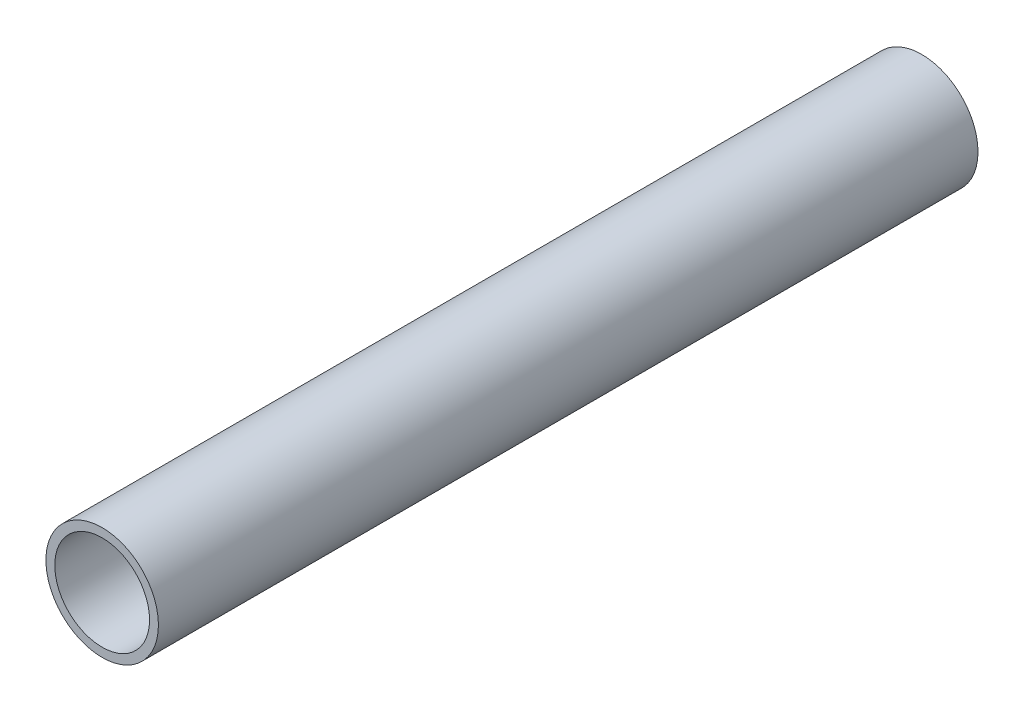
ISO-10303-21;
HEADER;
FILE_DESCRIPTION(('STEP AP214'),'2;1');
FILE_NAME('part.step','',(''),(''),'','','');
FILE_SCHEMA(('AUTOMOTIVE_DESIGN { 1 0 10303 214 1 1 1 1 }'));
ENDSEC;
DATA;
#1=APPLICATION_CONTEXT('core data for automotive mechanical design processes');
#2=APPLICATION_PROTOCOL_DEFINITION('international standard','automotive_design',2000,#1);
#3=PRODUCT_CONTEXT('',#1,'mechanical');
#4=PRODUCT('Part','Part','',(#3));
#5=PRODUCT_RELATED_PRODUCT_CATEGORY('part','',(#4));
#6=PRODUCT_DEFINITION_FORMATION('','',#4);
#7=PRODUCT_DEFINITION_CONTEXT('part definition',#1,'design');
#8=PRODUCT_DEFINITION('design','',#6,#7);
#9=PRODUCT_DEFINITION_SHAPE('','',#8);
#10=(LENGTH_UNIT() NAMED_UNIT(*) SI_UNIT(.MILLI.,.METRE.));
#11=(NAMED_UNIT(*) PLANE_ANGLE_UNIT() SI_UNIT($,.RADIAN.));
#12=(NAMED_UNIT(*) SI_UNIT($,.STERADIAN.) SOLID_ANGLE_UNIT());
#13=UNCERTAINTY_MEASURE_WITH_UNIT(LENGTH_MEASURE(1.E-05),#10,'distance_accuracy_value','');
#14=(GEOMETRIC_REPRESENTATION_CONTEXT(3) GLOBAL_UNCERTAINTY_ASSIGNED_CONTEXT((#13)) GLOBAL_UNIT_ASSIGNED_CONTEXT((#10,
#11,#12)) REPRESENTATION_CONTEXT('',''));
#15=CARTESIAN_POINT('',(0.,0.,0.));
#16=DIRECTION('',(0.,0.,1.));
#17=DIRECTION('',(1.,0.,0.));
#18=AXIS2_PLACEMENT_3D('',#15,#16,#17);
#19=CARTESIAN_POINT('',(0.,0.,185.));
#20=DIRECTION('',(0.,0.,1.));
#21=DIRECTION('',(1.,0.,0.));
#22=AXIS2_PLACEMENT_3D('',#19,#20,#21);
#23=PLANE('',#22);
#24=CARTESIAN_POINT('',(0.,0.,185.));
#25=DIRECTION('',(0.,0.,1.));
#26=DIRECTION('',(1.,0.,0.));
#27=AXIS2_PLACEMENT_3D('',#24,#25,#26);
#28=CIRCLE('',#27,12.7);
#29=CARTESIAN_POINT('',(12.7,0.,185.));
#30=VERTEX_POINT('',#29);
#31=EDGE_CURVE('E10',#30,#30,#28,.T.);
#32=ORIENTED_EDGE('',*,*,#31,.T.);
#33=EDGE_LOOP('',(#32));
#34=FACE_BOUND('',#33,.T.);
#35=CARTESIAN_POINT('',(0.,0.,185.));
#36=DIRECTION('',(0.,0.,1.));
#37=DIRECTION('',(1.,0.,0.));
#38=AXIS2_PLACEMENT_3D('',#35,#36,#37);
#39=CIRCLE('',#38,10.7);
#40=CARTESIAN_POINT('',(10.7,0.,185.));
#41=VERTEX_POINT('',#40);
#42=EDGE_CURVE('E43',#41,#41,#39,.T.);
#43=ORIENTED_EDGE('',*,*,#42,.F.);
#44=EDGE_LOOP('',(#43));
#45=FACE_BOUND('',#44,.T.);
#46=ADVANCED_FACE('F32',(#34,#45),#23,.T.);
#47=CARTESIAN_POINT('',(0.,0.,0.));
#48=DIRECTION('',(0.,0.,1.));
#49=DIRECTION('',(1.,0.,0.));
#50=AXIS2_PLACEMENT_3D('',#47,#48,#49);
#51=PLANE('',#50);
#52=CARTESIAN_POINT('',(0.,0.,0.));
#53=DIRECTION('',(0.,0.,1.));
#54=DIRECTION('',(1.,0.,0.));
#55=AXIS2_PLACEMENT_3D('',#52,#53,#54);
#56=CIRCLE('',#55,12.7);
#57=CARTESIAN_POINT('',(12.7,0.,0.));
#58=VERTEX_POINT('',#57);
#59=EDGE_CURVE('E36',#58,#58,#56,.T.);
#60=ORIENTED_EDGE('',*,*,#59,.F.);
#61=EDGE_LOOP('',(#60));
#62=FACE_BOUND('',#61,.T.);
#63=CARTESIAN_POINT('',(0.,0.,0.));
#64=DIRECTION('',(0.,0.,1.));
#65=DIRECTION('',(1.,0.,0.));
#66=AXIS2_PLACEMENT_3D('',#63,#64,#65);
#67=CIRCLE('',#66,10.7);
#68=CARTESIAN_POINT('',(10.7,0.,0.));
#69=VERTEX_POINT('',#68);
#70=EDGE_CURVE('E45',#69,#69,#67,.T.);
#71=ORIENTED_EDGE('',*,*,#70,.T.);
#72=EDGE_LOOP('',(#71));
#73=FACE_BOUND('',#72,.T.);
#74=ADVANCED_FACE('F55',(#62,#73),#51,.F.);
#75=CARTESIAN_POINT('',(0.,0.,185.));
#76=DIRECTION('',(0.,0.,-1.));
#77=DIRECTION('',(-1.,0.,0.));
#78=AXIS2_PLACEMENT_3D('',#75,#76,#77);
#79=CYLINDRICAL_SURFACE('',#78,12.7);
#80=ORIENTED_EDGE('',*,*,#31,.F.);
#81=EDGE_LOOP('',(#80));
#82=FACE_BOUND('',#81,.T.);
#83=ORIENTED_EDGE('',*,*,#59,.T.);
#84=EDGE_LOOP('',(#83));
#85=FACE_BOUND('',#84,.T.);
#86=ADVANCED_FACE('F34',(#82,#85),#79,.T.);
#87=CARTESIAN_POINT('',(0.,0.,185.));
#88=DIRECTION('',(0.,0.,-1.));
#89=DIRECTION('',(-1.,0.,0.));
#90=AXIS2_PLACEMENT_3D('',#87,#88,#89);
#91=CYLINDRICAL_SURFACE('',#90,10.7);
#92=ORIENTED_EDGE('',*,*,#42,.T.);
#93=EDGE_LOOP('',(#92));
#94=FACE_BOUND('',#93,.T.);
#95=ORIENTED_EDGE('',*,*,#70,.F.);
#96=EDGE_LOOP('',(#95));
#97=FACE_BOUND('',#96,.T.);
#98=ADVANCED_FACE('F51',(#94,#97),#91,.F.);
#99=CLOSED_SHELL('',(#46,#74,#86,#98));
#100=MANIFOLD_SOLID_BREP('B2',#99);
#101=ADVANCED_BREP_SHAPE_REPRESENTATION('',(#18,#100),#14);
#102=SHAPE_DEFINITION_REPRESENTATION(#9,#101);
ENDSEC;
END-ISO-10303-21;
